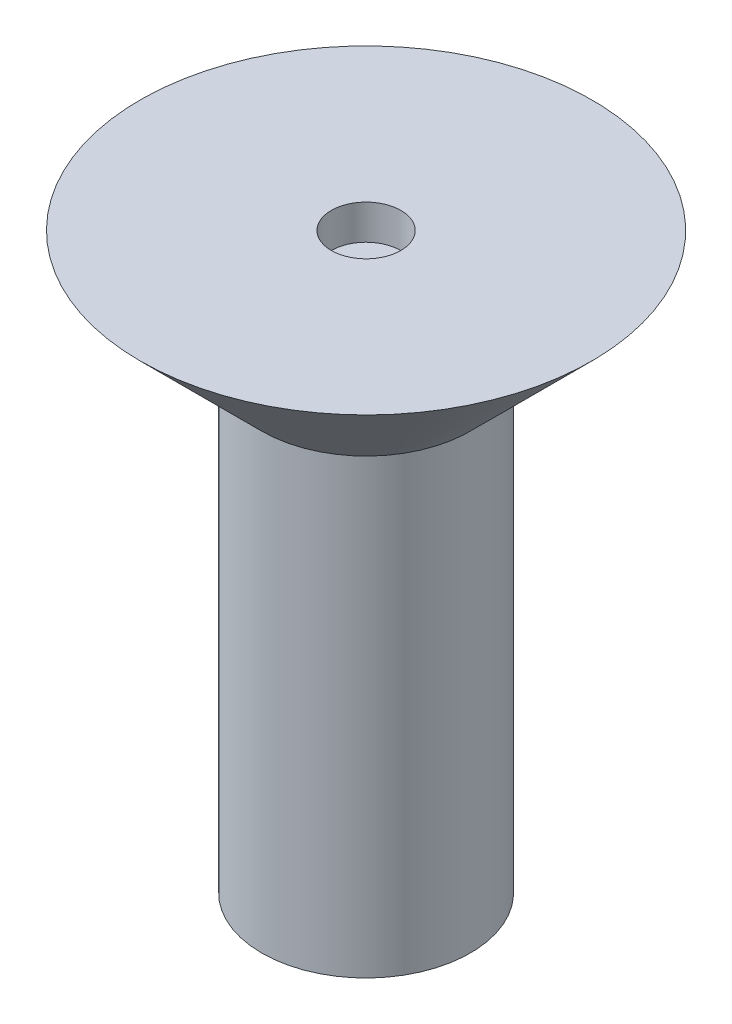
ISO-10303-21;
HEADER;
FILE_DESCRIPTION(('STEP AP214'),'2;1');
FILE_NAME('part.step','',(''),(''),'','','');
FILE_SCHEMA(('AUTOMOTIVE_DESIGN { 1 0 10303 214 1 1 1 1 }'));
ENDSEC;
DATA;
#1=APPLICATION_CONTEXT('core data for automotive mechanical design processes');
#2=APPLICATION_PROTOCOL_DEFINITION('international standard','automotive_design',2000,#1);
#3=PRODUCT_CONTEXT('',#1,'mechanical');
#4=PRODUCT('Part','Part','',(#3));
#5=PRODUCT_RELATED_PRODUCT_CATEGORY('part','',(#4));
#6=PRODUCT_DEFINITION_FORMATION('','',#4);
#7=PRODUCT_DEFINITION_CONTEXT('part definition',#1,'design');
#8=PRODUCT_DEFINITION('design','',#6,#7);
#9=PRODUCT_DEFINITION_SHAPE('','',#8);
#10=(LENGTH_UNIT() NAMED_UNIT(*) SI_UNIT(.MILLI.,.METRE.));
#11=(NAMED_UNIT(*) PLANE_ANGLE_UNIT() SI_UNIT($,.RADIAN.));
#12=(NAMED_UNIT(*) SI_UNIT($,.STERADIAN.) SOLID_ANGLE_UNIT());
#13=UNCERTAINTY_MEASURE_WITH_UNIT(LENGTH_MEASURE(1.E-05),#10,'distance_accuracy_value','');
#14=(GEOMETRIC_REPRESENTATION_CONTEXT(3) GLOBAL_UNCERTAINTY_ASSIGNED_CONTEXT((#13)) GLOBAL_UNIT_ASSIGNED_CONTEXT((#10,
#11,#12)) REPRESENTATION_CONTEXT('',''));
#15=CARTESIAN_POINT('',(0.,0.,0.));
#16=DIRECTION('',(0.,0.,1.));
#17=DIRECTION('',(1.,0.,0.));
#18=AXIS2_PLACEMENT_3D('',#15,#16,#17);
#19=CARTESIAN_POINT('',(0.,15.5,0.));
#20=DIRECTION('',(0.,-1.,0.));
#21=DIRECTION('',(0.,0.,-1.));
#22=AXIS2_PLACEMENT_3D('',#19,#20,#21);
#23=PLANE('',#22);
#24=CARTESIAN_POINT('',(0.,15.5,0.));
#25=DIRECTION('',(0.,1.,0.));
#26=DIRECTION('',(0.,0.,1.));
#27=AXIS2_PLACEMENT_3D('',#24,#25,#26);
#28=CIRCLE('',#27,0.999999999999992);
#29=CARTESIAN_POINT('',(0.,15.5,0.999999999999992));
#30=VERTEX_POINT('',#29);
#31=EDGE_CURVE('E11',#30,#30,#28,.T.);
#32=ORIENTED_EDGE('',*,*,#31,.T.);
#33=EDGE_LOOP('',(#32));
#34=FACE_BOUND('',#33,.T.);
#35=ADVANCED_FACE('F42',(#34),#23,.F.);
#36=CARTESIAN_POINT('',(0.,81.864304428598,0.));
#37=DIRECTION('',(0.,1.,0.));
#38=DIRECTION('',(0.,0.,1.));
#39=AXIS2_PLACEMENT_3D('',#36,#37,#38);
#40=CYLINDRICAL_SURFACE('',#39,0.999999999999992);
#41=ORIENTED_EDGE('',*,*,#31,.F.);
#42=EDGE_LOOP('',(#41));
#43=FACE_BOUND('',#42,.T.);
#44=CARTESIAN_POINT('',(0.,16.5,0.));
#45=DIRECTION('',(0.,1.,0.));
#46=DIRECTION('',(0.,0.,1.));
#47=AXIS2_PLACEMENT_3D('',#44,#45,#46);
#48=CIRCLE('',#47,0.999999999999992);
#49=CARTESIAN_POINT('',(0.,16.5,0.999999999999992));
#50=VERTEX_POINT('',#49);
#51=EDGE_CURVE('E49',#50,#50,#48,.T.);
#52=ORIENTED_EDGE('',*,*,#51,.T.);
#53=EDGE_LOOP('',(#52));
#54=FACE_BOUND('',#53,.T.);
#55=ADVANCED_FACE('F75',(#43,#54),#40,.F.);
#56=CARTESIAN_POINT('',(0.,16.5,0.));
#57=DIRECTION('',(0.,-1.,0.));
#58=DIRECTION('',(0.,0.,-1.));
#59=AXIS2_PLACEMENT_3D('',#56,#57,#58);
#60=PLANE('',#59);
#61=ORIENTED_EDGE('',*,*,#51,.F.);
#62=EDGE_LOOP('',(#61));
#63=FACE_BOUND('',#62,.T.);
#64=CARTESIAN_POINT('',(0.,16.5,0.));
#65=DIRECTION('',(0.,1.,0.));
#66=DIRECTION('',(0.,0.,1.));
#67=AXIS2_PLACEMENT_3D('',#64,#65,#66);
#68=CIRCLE('',#67,6.49999999999999);
#69=CARTESIAN_POINT('',(0.,16.5,6.49999999999999));
#70=VERTEX_POINT('',#69);
#71=EDGE_CURVE('E66',#70,#70,#68,.T.);
#72=ORIENTED_EDGE('',*,*,#71,.T.);
#73=EDGE_LOOP('',(#72));
#74=FACE_BOUND('',#73,.T.);
#75=ADVANCED_FACE('F77',(#63,#74),#60,.F.);
#76=CARTESIAN_POINT('',(0.,13.,0.));
#77=DIRECTION('',(0.,1.,0.));
#78=DIRECTION('',(0.,0.,1.));
#79=AXIS2_PLACEMENT_3D('',#76,#77,#78);
#80=CONICAL_SURFACE('',#79,3.,0.785398163397453);
#81=ORIENTED_EDGE('',*,*,#71,.F.);
#82=EDGE_LOOP('',(#81));
#83=FACE_BOUND('',#82,.T.);
#84=CARTESIAN_POINT('',(0.,13.,0.));
#85=DIRECTION('',(0.,1.,0.));
#86=DIRECTION('',(0.,0.,1.));
#87=AXIS2_PLACEMENT_3D('',#84,#85,#86);
#88=CIRCLE('',#87,3.);
#89=CARTESIAN_POINT('',(0.,13.,3.));
#90=VERTEX_POINT('',#89);
#91=EDGE_CURVE('E62',#90,#90,#88,.T.);
#92=ORIENTED_EDGE('',*,*,#91,.T.);
#93=EDGE_LOOP('',(#92));
#94=FACE_BOUND('',#93,.T.);
#95=ADVANCED_FACE('F80',(#83,#94),#80,.T.);
#96=CARTESIAN_POINT('',(0.,81.864304428598,0.));
#97=DIRECTION('',(0.,1.,0.));
#98=DIRECTION('',(0.,0.,1.));
#99=AXIS2_PLACEMENT_3D('',#96,#97,#98);
#100=CYLINDRICAL_SURFACE('',#99,3.);
#101=ORIENTED_EDGE('',*,*,#91,.F.);
#102=EDGE_LOOP('',(#101));
#103=FACE_BOUND('',#102,.T.);
#104=CARTESIAN_POINT('',(0.,0.,0.));
#105=DIRECTION('',(0.,1.,0.));
#106=DIRECTION('',(0.,0.,1.));
#107=AXIS2_PLACEMENT_3D('',#104,#105,#106);
#108=CIRCLE('',#107,3.);
#109=CARTESIAN_POINT('',(0.,0.,3.));
#110=VERTEX_POINT('',#109);
#111=EDGE_CURVE('E59',#110,#110,#108,.T.);
#112=ORIENTED_EDGE('',*,*,#111,.T.);
#113=EDGE_LOOP('',(#112));
#114=FACE_BOUND('',#113,.T.);
#115=ADVANCED_FACE('F55',(#103,#114),#100,.T.);
#116=CARTESIAN_POINT('',(0.,0.,0.));
#117=DIRECTION('',(0.,1.,0.));
#118=DIRECTION('',(0.,0.,1.));
#119=AXIS2_PLACEMENT_3D('',#116,#117,#118);
#120=CONICAL_SURFACE('',#119,3.,1.0471975511966);
#121=CARTESIAN_POINT('',(0.,-1.73205080756887,0.));
#122=VERTEX_POINT('',#121);
#123=VERTEX_LOOP('',#122);
#124=FACE_BOUND('',#123,.T.);
#125=ORIENTED_EDGE('',*,*,#111,.F.);
#126=EDGE_LOOP('',(#125));
#127=FACE_BOUND('',#126,.T.);
#128=ADVANCED_FACE('F52',(#124,#127),#120,.T.);
#129=CLOSED_SHELL('',(#35,#55,#75,#95,#115,#128));
#130=MANIFOLD_SOLID_BREP('B2',#129);
#131=ADVANCED_BREP_SHAPE_REPRESENTATION('',(#18,#130),#14);
#132=SHAPE_DEFINITION_REPRESENTATION(#9,#131);
ENDSEC;
END-ISO-10303-21;
